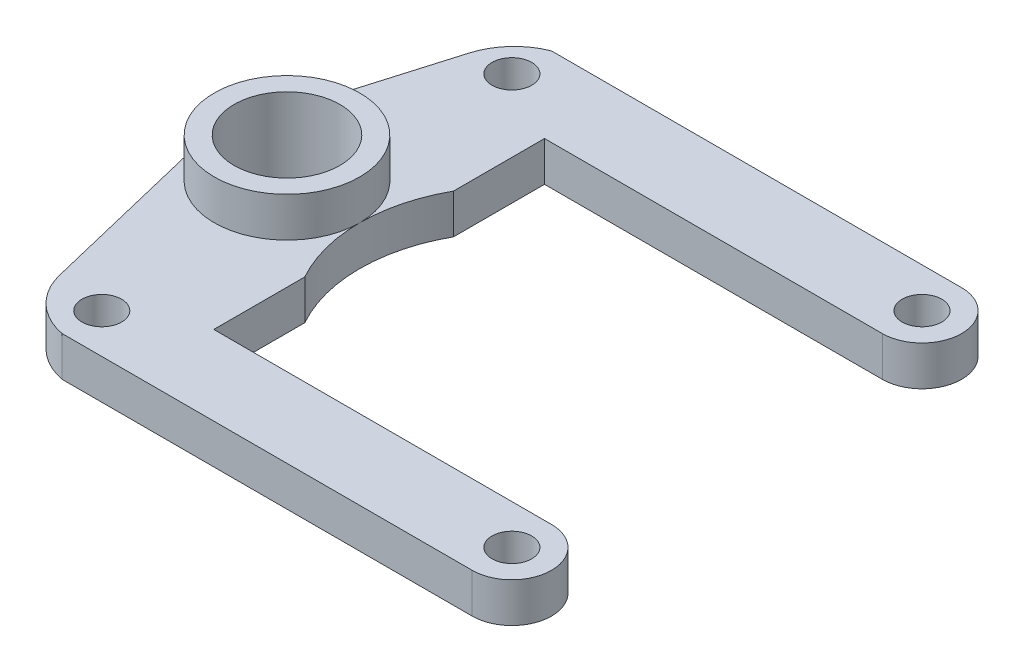
ISO-10303-21;
HEADER;
FILE_DESCRIPTION(('STEP AP214'),'2;1');
FILE_NAME('part.step','',(''),(''),'','','');
FILE_SCHEMA(('AUTOMOTIVE_DESIGN { 1 0 10303 214 1 1 1 1 }'));
ENDSEC;
DATA;
#1=APPLICATION_CONTEXT('core data for automotive mechanical design processes');
#2=APPLICATION_PROTOCOL_DEFINITION('international standard','automotive_design',2000,#1);
#3=PRODUCT_CONTEXT('',#1,'mechanical');
#4=PRODUCT('Part','Part','',(#3));
#5=PRODUCT_RELATED_PRODUCT_CATEGORY('part','',(#4));
#6=PRODUCT_DEFINITION_FORMATION('','',#4);
#7=PRODUCT_DEFINITION_CONTEXT('part definition',#1,'design');
#8=PRODUCT_DEFINITION('design','',#6,#7);
#9=PRODUCT_DEFINITION_SHAPE('','',#8);
#10=(LENGTH_UNIT() NAMED_UNIT(*) SI_UNIT(.MILLI.,.METRE.));
#11=(NAMED_UNIT(*) PLANE_ANGLE_UNIT() SI_UNIT($,.RADIAN.));
#12=(NAMED_UNIT(*) SI_UNIT($,.STERADIAN.) SOLID_ANGLE_UNIT());
#13=UNCERTAINTY_MEASURE_WITH_UNIT(LENGTH_MEASURE(1.E-05),#10,'distance_accuracy_value','');
#14=(GEOMETRIC_REPRESENTATION_CONTEXT(3) GLOBAL_UNCERTAINTY_ASSIGNED_CONTEXT((#13)) GLOBAL_UNIT_ASSIGNED_CONTEXT((#10,
#11,#12)) REPRESENTATION_CONTEXT('',''));
#15=CARTESIAN_POINT('',(0.,0.,0.));
#16=DIRECTION('',(0.,0.,1.));
#17=DIRECTION('',(1.,0.,0.));
#18=AXIS2_PLACEMENT_3D('',#15,#16,#17);
#19=CARTESIAN_POINT('',(31.,3.,0.));
#20=DIRECTION('',(0.,-1.,0.));
#21=DIRECTION('',(0.,0.,-1.));
#22=AXIS2_PLACEMENT_3D('',#19,#20,#21);
#23=PLANE('',#22);
#24=CARTESIAN_POINT('',(31.,3.,0.));
#25=DIRECTION('',(0.,1.,0.));
#26=DIRECTION('',(0.,0.,1.));
#27=AXIS2_PLACEMENT_3D('',#24,#25,#26);
#28=CIRCLE('',#27,1.5);
#29=CARTESIAN_POINT('',(31.,3.,1.5));
#30=VERTEX_POINT('',#29);
#31=EDGE_CURVE('E286',#30,#30,#28,.T.);
#32=ORIENTED_EDGE('',*,*,#31,.F.);
#33=EDGE_LOOP('',(#32));
#34=FACE_BOUND('',#33,.T.);
#35=CARTESIAN_POINT('',(0.,3.,-31.));
#36=DIRECTION('',(0.,1.,0.));
#37=DIRECTION('',(0.,0.,1.));
#38=AXIS2_PLACEMENT_3D('',#35,#36,#37);
#39=CIRCLE('',#38,1.5);
#40=CARTESIAN_POINT('',(0.,3.,-29.5));
#41=VERTEX_POINT('',#40);
#42=EDGE_CURVE('E163',#41,#41,#39,.T.);
#43=ORIENTED_EDGE('',*,*,#42,.F.);
#44=EDGE_LOOP('',(#43));
#45=FACE_BOUND('',#44,.T.);
#46=CARTESIAN_POINT('',(31.,3.,-31.));
#47=DIRECTION('',(0.,1.,0.));
#48=DIRECTION('',(0.,0.,1.));
#49=AXIS2_PLACEMENT_3D('',#46,#47,#48);
#50=CIRCLE('',#49,1.5);
#51=CARTESIAN_POINT('',(31.,3.,-29.5));
#52=VERTEX_POINT('',#51);
#53=EDGE_CURVE('E292',#52,#52,#50,.T.);
#54=ORIENTED_EDGE('',*,*,#53,.F.);
#55=EDGE_LOOP('',(#54));
#56=FACE_BOUND('',#55,.T.);
#57=CARTESIAN_POINT('',(0.,3.,0.));
#58=DIRECTION('',(0.,1.,0.));
#59=DIRECTION('',(0.,0.,1.));
#60=AXIS2_PLACEMENT_3D('',#57,#58,#59);
#61=CIRCLE('',#60,1.5);
#62=CARTESIAN_POINT('',(0.,3.,1.5));
#63=VERTEX_POINT('',#62);
#64=EDGE_CURVE('E280',#63,#63,#61,.T.);
#65=ORIENTED_EDGE('',*,*,#64,.F.);
#66=EDGE_LOOP('',(#65));
#67=FACE_BOUND('',#66,.T.);
#68=CARTESIAN_POINT('',(15.5,3.,-15.5));
#69=DIRECTION('',(0.,1.,0.));
#70=DIRECTION('',(0.,0.,1.));
#71=AXIS2_PLACEMENT_3D('',#68,#69,#70);
#72=CIRCLE('',#71,11.5);
#73=CARTESIAN_POINT('',(4.,3.,-15.5));
#74=VERTEX_POINT('',#73);
#75=CARTESIAN_POINT('',(5.46707237634791,3.,-9.87946948246351));
#76=VERTEX_POINT('',#75);
#77=EDGE_CURVE('E270',#74,#76,#72,.T.);
#78=ORIENTED_EDGE('',*,*,#77,.F.);
#79=CARTESIAN_POINT('',(-1.5,3.,-15.5));
#80=DIRECTION('',(0.,1.,0.));
#81=DIRECTION('',(0.,0.,1.));
#82=AXIS2_PLACEMENT_3D('',#79,#80,#81);
#83=CIRCLE('',#82,5.50000000000001);
#84=EDGE_CURVE('E267',#74,#74,#83,.T.);
#85=ORIENTED_EDGE('',*,*,#84,.F.);
#86=CARTESIAN_POINT('',(5.46707237634791,3.,-21.1205305175365));
#87=VERTEX_POINT('',#86);
#88=EDGE_CURVE('E264',#87,#74,#72,.T.);
#89=ORIENTED_EDGE('',*,*,#88,.F.);
#90=DIRECTION('',(0.,0.,-1.));
#91=VECTOR('',#90,1.);
#92=CARTESIAN_POINT('',(5.46707237634791,3.,-3.));
#93=LINE('',#92,#91);
#94=CARTESIAN_POINT('',(5.46707237634791,3.,-28.));
#95=VERTEX_POINT('',#94);
#96=EDGE_CURVE('E212',#87,#95,#93,.T.);
#97=ORIENTED_EDGE('',*,*,#96,.T.);
#98=DIRECTION('',(1.,0.,0.));
#99=VECTOR('',#98,1.);
#100=CARTESIAN_POINT('',(31.,3.,-28.));
#101=LINE('',#100,#99);
#102=CARTESIAN_POINT('',(31.,3.,-28.));
#103=VERTEX_POINT('',#102);
#104=EDGE_CURVE('E233',#95,#103,#101,.T.);
#105=ORIENTED_EDGE('',*,*,#104,.T.);
#106=CARTESIAN_POINT('',(31.,3.,-31.));
#107=DIRECTION('',(0.,1.,0.));
#108=DIRECTION('',(0.,0.,1.));
#109=AXIS2_PLACEMENT_3D('',#106,#107,#108);
#110=CIRCLE('',#109,3.);
#111=CARTESIAN_POINT('',(31.,3.,-34.));
#112=VERTEX_POINT('',#111);
#113=EDGE_CURVE('E230',#103,#112,#110,.T.);
#114=ORIENTED_EDGE('',*,*,#113,.T.);
#115=DIRECTION('',(-1.,0.,0.));
#116=VECTOR('',#115,1.);
#117=CARTESIAN_POINT('',(31.,3.,-34.));
#118=LINE('',#117,#116);
#119=CARTESIAN_POINT('',(0.,3.,-34.));
#120=VERTEX_POINT('',#119);
#121=EDGE_CURVE('E232',#112,#120,#118,.T.);
#122=ORIENTED_EDGE('',*,*,#121,.T.);
#123=CARTESIAN_POINT('',(1.82034544868609,3.,-29.3431402804628));
#124=DIRECTION('',(0.,1.,0.));
#125=DIRECTION('',(0.,0.,-1.));
#126=AXIS2_PLACEMENT_3D('',#123,#124,#125);
#127=CIRCLE('',#126,5.);
#128=CARTESIAN_POINT('',(-2.97461169510243,3.,-30.7603156363139));
#129=VERTEX_POINT('',#128);
#130=EDGE_CURVE('E235',#120,#129,#127,.T.);
#131=ORIENTED_EDGE('',*,*,#130,.T.);
#132=DIRECTION('',(-0.283435071170205,0.,0.958991428757703));
#133=VECTOR('',#132,1.);
#134=CARTESIAN_POINT('',(-7.48488000277803,3.,-15.5));
#135=LINE('',#134,#133);
#136=CARTESIAN_POINT('',(-7.48488000277803,3.,-15.5));
#137=VERTEX_POINT('',#136);
#138=EDGE_CURVE('E138',#129,#137,#135,.T.);
#139=ORIENTED_EDGE('',*,*,#138,.T.);
#140=DIRECTION('',(0.23488767197672,0.,0.972022521114278));
#141=VECTOR('',#140,1.);
#142=CARTESIAN_POINT('',(-7.48488000277803,3.,-15.5));
#143=LINE('',#142,#141);
#144=CARTESIAN_POINT('',(-3.91714401533258,3.,-0.735837623991746));
#145=VERTEX_POINT('',#144);
#146=EDGE_CURVE('E131',#137,#145,#143,.T.);
#147=ORIENTED_EDGE('',*,*,#146,.T.);
#148=CARTESIAN_POINT('',(0.942968590238806,3.,-1.91027598387535));
#149=DIRECTION('',(0.,1.,0.));
#150=DIRECTION('',(0.,0.,1.));
#151=AXIS2_PLACEMENT_3D('',#148,#149,#150);
#152=CIRCLE('',#151,5.);
#153=CARTESIAN_POINT('',(0.,3.,3.));
#154=VERTEX_POINT('',#153);
#155=EDGE_CURVE('E135',#145,#154,#152,.T.);
#156=ORIENTED_EDGE('',*,*,#155,.T.);
#157=DIRECTION('',(1.,0.,0.));
#158=VECTOR('',#157,1.);
#159=CARTESIAN_POINT('',(31.,3.,3.));
#160=LINE('',#159,#158);
#161=CARTESIAN_POINT('',(31.,3.,3.));
#162=VERTEX_POINT('',#161);
#163=EDGE_CURVE('E56',#154,#162,#160,.T.);
#164=ORIENTED_EDGE('',*,*,#163,.T.);
#165=CARTESIAN_POINT('',(31.,3.,0.));
#166=DIRECTION('',(0.,1.,0.));
#167=DIRECTION('',(0.,0.,-1.));
#168=AXIS2_PLACEMENT_3D('',#165,#166,#167);
#169=CIRCLE('',#168,3.);
#170=CARTESIAN_POINT('',(31.,3.,-3.));
#171=VERTEX_POINT('',#170);
#172=EDGE_CURVE('E183',#162,#171,#169,.T.);
#173=ORIENTED_EDGE('',*,*,#172,.T.);
#174=DIRECTION('',(-1.,0.,0.));
#175=VECTOR('',#174,1.);
#176=CARTESIAN_POINT('',(31.,3.,-3.));
#177=LINE('',#176,#175);
#178=CARTESIAN_POINT('',(5.46707237634791,3.,-3.));
#179=VERTEX_POINT('',#178);
#180=EDGE_CURVE('E107',#171,#179,#177,.T.);
#181=ORIENTED_EDGE('',*,*,#180,.T.);
#182=EDGE_CURVE('E237',#179,#76,#93,.T.);
#183=ORIENTED_EDGE('',*,*,#182,.T.);
#184=EDGE_LOOP('',(#78,#85,#89,#97,#105,#114,#122,#131,#139,#147,#156,#164,#173,#181,#183));
#185=FACE_BOUND('',#184,.T.);
#186=ADVANCED_FACE('F32',(#34,#45,#56,#67,#185),#23,.F.);
#187=CARTESIAN_POINT('',(5.46707237634791,3.,-3.));
#188=DIRECTION('',(-1.,0.,0.));
#189=DIRECTION('',(0.,0.,1.));
#190=AXIS2_PLACEMENT_3D('',#187,#188,#189);
#191=PLANE('',#190);
#192=DIRECTION('',(0.,0.,-1.));
#193=VECTOR('',#192,1.);
#194=CARTESIAN_POINT('',(5.46707237634791,0.,-3.));
#195=LINE('',#194,#193);
#196=CARTESIAN_POINT('',(5.46707237634791,0.,-3.));
#197=VERTEX_POINT('',#196);
#198=CARTESIAN_POINT('',(5.46707237634791,0.,-9.87946948246351));
#199=VERTEX_POINT('',#198);
#200=EDGE_CURVE('E166',#197,#199,#195,.T.);
#201=ORIENTED_EDGE('',*,*,#200,.T.);
#202=DIRECTION('',(0.,1.,0.));
#203=VECTOR('',#202,1.);
#204=CARTESIAN_POINT('',(5.46707237634791,0.,-9.87946948246351));
#205=LINE('',#204,#203);
#206=EDGE_CURVE('E11',#199,#76,#205,.T.);
#207=ORIENTED_EDGE('',*,*,#206,.T.);
#208=ORIENTED_EDGE('',*,*,#182,.F.);
#209=DIRECTION('',(0.,-1.,0.));
#210=VECTOR('',#209,1.);
#211=CARTESIAN_POINT('',(5.46707237634791,3.,-3.));
#212=LINE('',#211,#210);
#213=EDGE_CURVE('E202',#179,#197,#212,.T.);
#214=ORIENTED_EDGE('',*,*,#213,.T.);
#215=EDGE_LOOP('',(#201,#207,#208,#214));
#216=FACE_BOUND('',#215,.T.);
#217=ADVANCED_FACE('F318',(#216),#191,.F.);
#218=CARTESIAN_POINT('',(31.,0.,0.));
#219=DIRECTION('',(0.,-1.,0.));
#220=DIRECTION('',(0.,0.,-1.));
#221=AXIS2_PLACEMENT_3D('',#218,#219,#220);
#222=PLANE('',#221);
#223=CARTESIAN_POINT('',(15.5,0.,-15.5));
#224=DIRECTION('',(0.,1.,0.));
#225=DIRECTION('',(0.,0.,1.));
#226=AXIS2_PLACEMENT_3D('',#223,#224,#225);
#227=CIRCLE('',#226,11.5);
#228=CARTESIAN_POINT('',(5.46707237634791,0.,-21.1205305175365));
#229=VERTEX_POINT('',#228);
#230=EDGE_CURVE('E47',#229,#199,#227,.T.);
#231=ORIENTED_EDGE('',*,*,#230,.T.);
#232=ORIENTED_EDGE('',*,*,#200,.F.);
#233=DIRECTION('',(-1.,0.,0.));
#234=VECTOR('',#233,1.);
#235=CARTESIAN_POINT('',(31.,0.,-3.));
#236=LINE('',#235,#234);
#237=CARTESIAN_POINT('',(31.,0.,-3.));
#238=VERTEX_POINT('',#237);
#239=EDGE_CURVE('E162',#238,#197,#236,.T.);
#240=ORIENTED_EDGE('',*,*,#239,.F.);
#241=CARTESIAN_POINT('',(31.,0.,0.));
#242=DIRECTION('',(0.,1.,0.));
#243=DIRECTION('',(0.,0.,-1.));
#244=AXIS2_PLACEMENT_3D('',#241,#242,#243);
#245=CIRCLE('',#244,3.);
#246=CARTESIAN_POINT('',(31.,0.,3.));
#247=VERTEX_POINT('',#246);
#248=EDGE_CURVE('E159',#247,#238,#245,.T.);
#249=ORIENTED_EDGE('',*,*,#248,.F.);
#250=DIRECTION('',(1.,0.,0.));
#251=VECTOR('',#250,1.);
#252=CARTESIAN_POINT('',(31.,0.,3.));
#253=LINE('',#252,#251);
#254=CARTESIAN_POINT('',(0.,0.,3.));
#255=VERTEX_POINT('',#254);
#256=EDGE_CURVE('E98',#255,#247,#253,.T.);
#257=ORIENTED_EDGE('',*,*,#256,.F.);
#258=CARTESIAN_POINT('',(0.942968590238806,0.,-1.91027598387535));
#259=DIRECTION('',(0.,1.,0.));
#260=DIRECTION('',(0.,0.,1.));
#261=AXIS2_PLACEMENT_3D('',#258,#259,#260);
#262=CIRCLE('',#261,5.);
#263=CARTESIAN_POINT('',(-3.91714401533258,0.,-0.735837623991746));
#264=VERTEX_POINT('',#263);
#265=EDGE_CURVE('E180',#264,#255,#262,.T.);
#266=ORIENTED_EDGE('',*,*,#265,.F.);
#267=DIRECTION('',(0.23488767197672,0.,0.972022521114278));
#268=VECTOR('',#267,1.);
#269=CARTESIAN_POINT('',(-7.48488000277803,0.,-15.5));
#270=LINE('',#269,#268);
#271=CARTESIAN_POINT('',(-7.48488000277803,0.,-15.5));
#272=VERTEX_POINT('',#271);
#273=EDGE_CURVE('E147',#272,#264,#270,.T.);
#274=ORIENTED_EDGE('',*,*,#273,.F.);
#275=DIRECTION('',(-0.283435071170205,0.,0.958991428757703));
#276=VECTOR('',#275,1.);
#277=CARTESIAN_POINT('',(-7.48488000277803,0.,-15.5));
#278=LINE('',#277,#276);
#279=CARTESIAN_POINT('',(-2.97461169510243,0.,-30.7603156363139));
#280=VERTEX_POINT('',#279);
#281=EDGE_CURVE('E177',#280,#272,#278,.T.);
#282=ORIENTED_EDGE('',*,*,#281,.F.);
#283=CARTESIAN_POINT('',(1.82034544868609,0.,-29.3431402804628));
#284=DIRECTION('',(0.,1.,0.));
#285=DIRECTION('',(0.,0.,-1.));
#286=AXIS2_PLACEMENT_3D('',#283,#284,#285);
#287=CIRCLE('',#286,5.);
#288=CARTESIAN_POINT('',(0.,0.,-34.));
#289=VERTEX_POINT('',#288);
#290=EDGE_CURVE('E175',#289,#280,#287,.T.);
#291=ORIENTED_EDGE('',*,*,#290,.F.);
#292=DIRECTION('',(-1.,0.,0.));
#293=VECTOR('',#292,1.);
#294=CARTESIAN_POINT('',(31.,0.,-34.));
#295=LINE('',#294,#293);
#296=CARTESIAN_POINT('',(31.,0.,-34.));
#297=VERTEX_POINT('',#296);
#298=EDGE_CURVE('E173',#297,#289,#295,.T.);
#299=ORIENTED_EDGE('',*,*,#298,.F.);
#300=CARTESIAN_POINT('',(31.,0.,-31.));
#301=DIRECTION('',(0.,1.,0.));
#302=DIRECTION('',(0.,0.,1.));
#303=AXIS2_PLACEMENT_3D('',#300,#301,#302);
#304=CIRCLE('',#303,3.);
#305=CARTESIAN_POINT('',(31.,0.,-28.));
#306=VERTEX_POINT('',#305);
#307=EDGE_CURVE('E171',#306,#297,#304,.T.);
#308=ORIENTED_EDGE('',*,*,#307,.F.);
#309=DIRECTION('',(1.,0.,0.));
#310=VECTOR('',#309,1.);
#311=CARTESIAN_POINT('',(31.,0.,-28.));
#312=LINE('',#311,#310);
#313=CARTESIAN_POINT('',(5.46707237634791,0.,-28.));
#314=VERTEX_POINT('',#313);
#315=EDGE_CURVE('E169',#314,#306,#312,.T.);
#316=ORIENTED_EDGE('',*,*,#315,.F.);
#317=EDGE_CURVE('E165',#229,#314,#195,.T.);
#318=ORIENTED_EDGE('',*,*,#317,.F.);
#319=EDGE_LOOP('',(#231,#232,#240,#249,#257,#266,#274,#282,#291,#299,#308,#316,#318));
#320=FACE_BOUND('',#319,.T.);
#321=CARTESIAN_POINT('',(0.,0.,0.));
#322=DIRECTION('',(0.,1.,0.));
#323=DIRECTION('',(0.,0.,1.));
#324=AXIS2_PLACEMENT_3D('',#321,#322,#323);
#325=CIRCLE('',#324,1.5);
#326=CARTESIAN_POINT('',(0.,0.,1.5));
#327=VERTEX_POINT('',#326);
#328=EDGE_CURVE('E279',#327,#327,#325,.T.);
#329=ORIENTED_EDGE('',*,*,#328,.T.);
#330=EDGE_LOOP('',(#329));
#331=FACE_BOUND('',#330,.T.);
#332=CARTESIAN_POINT('',(31.,0.,-31.));
#333=DIRECTION('',(0.,1.,0.));
#334=DIRECTION('',(0.,0.,1.));
#335=AXIS2_PLACEMENT_3D('',#332,#333,#334);
#336=CIRCLE('',#335,1.5);
#337=CARTESIAN_POINT('',(31.,0.,-29.5));
#338=VERTEX_POINT('',#337);
#339=EDGE_CURVE('E289',#338,#338,#336,.T.);
#340=ORIENTED_EDGE('',*,*,#339,.T.);
#341=EDGE_LOOP('',(#340));
#342=FACE_BOUND('',#341,.T.);
#343=CARTESIAN_POINT('',(0.,0.,-31.));
#344=DIRECTION('',(0.,1.,0.));
#345=DIRECTION('',(0.,0.,1.));
#346=AXIS2_PLACEMENT_3D('',#343,#344,#345);
#347=CIRCLE('',#346,1.5);
#348=CARTESIAN_POINT('',(0.,0.,-29.5));
#349=VERTEX_POINT('',#348);
#350=EDGE_CURVE('E258',#349,#349,#347,.T.);
#351=ORIENTED_EDGE('',*,*,#350,.T.);
#352=EDGE_LOOP('',(#351));
#353=FACE_BOUND('',#352,.T.);
#354=CARTESIAN_POINT('',(31.,0.,0.));
#355=DIRECTION('',(0.,1.,0.));
#356=DIRECTION('',(0.,0.,1.));
#357=AXIS2_PLACEMENT_3D('',#354,#355,#356);
#358=CIRCLE('',#357,1.5);
#359=CARTESIAN_POINT('',(31.,0.,1.5));
#360=VERTEX_POINT('',#359);
#361=EDGE_CURVE('E283',#360,#360,#358,.T.);
#362=ORIENTED_EDGE('',*,*,#361,.T.);
#363=EDGE_LOOP('',(#362));
#364=FACE_BOUND('',#363,.T.);
#365=CARTESIAN_POINT('',(-1.5,0.,-15.5));
#366=DIRECTION('',(0.,1.,0.));
#367=DIRECTION('',(0.,0.,1.));
#368=AXIS2_PLACEMENT_3D('',#365,#366,#367);
#369=CIRCLE('',#368,4.);
#370=CARTESIAN_POINT('',(-1.5,0.,-11.5));
#371=VERTEX_POINT('',#370);
#372=EDGE_CURVE('E272',#371,#371,#369,.T.);
#373=ORIENTED_EDGE('',*,*,#372,.T.);
#374=EDGE_LOOP('',(#373));
#375=FACE_BOUND('',#374,.T.);
#376=ADVANCED_FACE('F217',(#320,#331,#342,#353,#364,#375),#222,.T.);
#377=CARTESIAN_POINT('',(31.,3.,0.));
#378=DIRECTION('',(0.,-1.,0.));
#379=DIRECTION('',(0.,0.,-1.));
#380=AXIS2_PLACEMENT_3D('',#377,#378,#379);
#381=CYLINDRICAL_SURFACE('',#380,3.);
#382=ORIENTED_EDGE('',*,*,#248,.T.);
#383=DIRECTION('',(0.,-1.,0.));
#384=VECTOR('',#383,1.);
#385=CARTESIAN_POINT('',(31.,3.,-3.));
#386=LINE('',#385,#384);
#387=EDGE_CURVE('E205',#171,#238,#386,.T.);
#388=ORIENTED_EDGE('',*,*,#387,.F.);
#389=ORIENTED_EDGE('',*,*,#172,.F.);
#390=DIRECTION('',(0.,-1.,0.));
#391=VECTOR('',#390,1.);
#392=CARTESIAN_POINT('',(31.,3.,3.));
#393=LINE('',#392,#391);
#394=EDGE_CURVE('E155',#162,#247,#393,.T.);
#395=ORIENTED_EDGE('',*,*,#394,.T.);
#396=EDGE_LOOP('',(#382,#388,#389,#395));
#397=FACE_BOUND('',#396,.T.);
#398=ADVANCED_FACE('F34',(#397),#381,.T.);
#399=CARTESIAN_POINT('',(31.,3.,-3.));
#400=DIRECTION('',(0.,0.,1.));
#401=DIRECTION('',(1.,0.,0.));
#402=AXIS2_PLACEMENT_3D('',#399,#400,#401);
#403=PLANE('',#402);
#404=ORIENTED_EDGE('',*,*,#239,.T.);
#405=ORIENTED_EDGE('',*,*,#213,.F.);
#406=ORIENTED_EDGE('',*,*,#180,.F.);
#407=ORIENTED_EDGE('',*,*,#387,.T.);
#408=EDGE_LOOP('',(#404,#405,#406,#407));
#409=FACE_BOUND('',#408,.T.);
#410=ADVANCED_FACE('F346',(#409),#403,.F.);
#411=ORIENTED_EDGE('',*,*,#96,.F.);
#412=DIRECTION('',(0.,1.,0.));
#413=VECTOR('',#412,1.);
#414=CARTESIAN_POINT('',(5.46707237634791,0.,-21.1205305175365));
#415=LINE('',#414,#413);
#416=EDGE_CURVE('E40',#87,#229,#415,.F.);
#417=ORIENTED_EDGE('',*,*,#416,.T.);
#418=ORIENTED_EDGE('',*,*,#317,.T.);
#419=DIRECTION('',(0.,-1.,0.));
#420=VECTOR('',#419,1.);
#421=CARTESIAN_POINT('',(5.46707237634791,3.,-28.));
#422=LINE('',#421,#420);
#423=EDGE_CURVE('E199',#95,#314,#422,.T.);
#424=ORIENTED_EDGE('',*,*,#423,.F.);
#425=EDGE_LOOP('',(#411,#417,#418,#424));
#426=FACE_BOUND('',#425,.T.);
#427=ADVANCED_FACE('F209',(#426),#191,.F.);
#428=CARTESIAN_POINT('',(31.,3.,-28.));
#429=DIRECTION('',(0.,0.,-1.));
#430=DIRECTION('',(-1.,0.,0.));
#431=AXIS2_PLACEMENT_3D('',#428,#429,#430);
#432=PLANE('',#431);
#433=ORIENTED_EDGE('',*,*,#315,.T.);
#434=DIRECTION('',(0.,-1.,0.));
#435=VECTOR('',#434,1.);
#436=CARTESIAN_POINT('',(31.,3.,-28.));
#437=LINE('',#436,#435);
#438=EDGE_CURVE('E196',#103,#306,#437,.T.);
#439=ORIENTED_EDGE('',*,*,#438,.F.);
#440=ORIENTED_EDGE('',*,*,#104,.F.);
#441=ORIENTED_EDGE('',*,*,#423,.T.);
#442=EDGE_LOOP('',(#433,#439,#440,#441));
#443=FACE_BOUND('',#442,.T.);
#444=ADVANCED_FACE('F224',(#443),#432,.F.);
#445=CARTESIAN_POINT('',(31.,3.,-31.));
#446=DIRECTION('',(0.,-1.,0.));
#447=DIRECTION('',(0.,0.,-1.));
#448=AXIS2_PLACEMENT_3D('',#445,#446,#447);
#449=CYLINDRICAL_SURFACE('',#448,3.);
#450=ORIENTED_EDGE('',*,*,#307,.T.);
#451=DIRECTION('',(0.,-1.,0.));
#452=VECTOR('',#451,1.);
#453=CARTESIAN_POINT('',(31.,3.,-34.));
#454=LINE('',#453,#452);
#455=EDGE_CURVE('E193',#112,#297,#454,.T.);
#456=ORIENTED_EDGE('',*,*,#455,.F.);
#457=ORIENTED_EDGE('',*,*,#113,.F.);
#458=ORIENTED_EDGE('',*,*,#438,.T.);
#459=EDGE_LOOP('',(#450,#456,#457,#458));
#460=FACE_BOUND('',#459,.T.);
#461=ADVANCED_FACE('F228',(#460),#449,.T.);
#462=CARTESIAN_POINT('',(31.,3.,-34.));
#463=DIRECTION('',(0.,0.,1.));
#464=DIRECTION('',(1.,0.,0.));
#465=AXIS2_PLACEMENT_3D('',#462,#463,#464);
#466=PLANE('',#465);
#467=ORIENTED_EDGE('',*,*,#298,.T.);
#468=DIRECTION('',(0.,-1.,0.));
#469=VECTOR('',#468,1.);
#470=CARTESIAN_POINT('',(0.,3.,-34.));
#471=LINE('',#470,#469);
#472=EDGE_CURVE('E190',#120,#289,#471,.T.);
#473=ORIENTED_EDGE('',*,*,#472,.F.);
#474=ORIENTED_EDGE('',*,*,#121,.F.);
#475=ORIENTED_EDGE('',*,*,#455,.T.);
#476=EDGE_LOOP('',(#467,#473,#474,#475));
#477=FACE_BOUND('',#476,.T.);
#478=ADVANCED_FACE('F338',(#477),#466,.F.);
#479=CARTESIAN_POINT('',(1.82034544868609,3.,-29.3431402804628));
#480=DIRECTION('',(0.,-1.,0.));
#481=DIRECTION('',(0.,0.,-1.));
#482=AXIS2_PLACEMENT_3D('',#479,#480,#481);
#483=CYLINDRICAL_SURFACE('',#482,5.);
#484=ORIENTED_EDGE('',*,*,#290,.T.);
#485=DIRECTION('',(0.,-1.,0.));
#486=VECTOR('',#485,1.);
#487=CARTESIAN_POINT('',(-2.97461169510243,3.,-30.7603156363139));
#488=LINE('',#487,#486);
#489=EDGE_CURVE('E187',#129,#280,#488,.T.);
#490=ORIENTED_EDGE('',*,*,#489,.F.);
#491=ORIENTED_EDGE('',*,*,#130,.F.);
#492=ORIENTED_EDGE('',*,*,#472,.T.);
#493=EDGE_LOOP('',(#484,#490,#491,#492));
#494=FACE_BOUND('',#493,.T.);
#495=ADVANCED_FACE('F245',(#494),#483,.T.);
#496=CARTESIAN_POINT('',(-7.48488000277803,3.,-15.5));
#497=DIRECTION('',(0.958991428757703,0.,0.283435071170205));
#498=DIRECTION('',(0.283435071170205,0.,-0.958991428757703));
#499=AXIS2_PLACEMENT_3D('',#496,#497,#498);
#500=PLANE('',#499);
#501=ORIENTED_EDGE('',*,*,#281,.T.);
#502=DIRECTION('',(0.,-1.,0.));
#503=VECTOR('',#502,1.);
#504=CARTESIAN_POINT('',(-7.48488000277803,3.,-15.5));
#505=LINE('',#504,#503);
#506=EDGE_CURVE('E150',#137,#272,#505,.T.);
#507=ORIENTED_EDGE('',*,*,#506,.F.);
#508=ORIENTED_EDGE('',*,*,#138,.F.);
#509=ORIENTED_EDGE('',*,*,#489,.T.);
#510=EDGE_LOOP('',(#501,#507,#508,#509));
#511=FACE_BOUND('',#510,.T.);
#512=ADVANCED_FACE('F249',(#511),#500,.F.);
#513=CARTESIAN_POINT('',(-7.48488000277803,3.,-15.5));
#514=DIRECTION('',(0.972022521114278,0.,-0.23488767197672));
#515=DIRECTION('',(-0.23488767197672,0.,-0.972022521114278));
#516=AXIS2_PLACEMENT_3D('',#513,#514,#515);
#517=PLANE('',#516);
#518=ORIENTED_EDGE('',*,*,#273,.T.);
#519=DIRECTION('',(0.,-1.,0.));
#520=VECTOR('',#519,1.);
#521=CARTESIAN_POINT('',(-3.91714401533258,3.,-0.735837623991746));
#522=LINE('',#521,#520);
#523=EDGE_CURVE('E144',#145,#264,#522,.T.);
#524=ORIENTED_EDGE('',*,*,#523,.F.);
#525=ORIENTED_EDGE('',*,*,#146,.F.);
#526=ORIENTED_EDGE('',*,*,#506,.T.);
#527=EDGE_LOOP('',(#518,#524,#525,#526));
#528=FACE_BOUND('',#527,.T.);
#529=ADVANCED_FACE('F145',(#528),#517,.F.);
#530=CARTESIAN_POINT('',(0.942968590238806,3.,-1.91027598387535));
#531=DIRECTION('',(0.,-1.,0.));
#532=DIRECTION('',(0.,0.,-1.));
#533=AXIS2_PLACEMENT_3D('',#530,#531,#532);
#534=CYLINDRICAL_SURFACE('',#533,5.);
#535=ORIENTED_EDGE('',*,*,#265,.T.);
#536=DIRECTION('',(0.,-1.,0.));
#537=VECTOR('',#536,1.);
#538=CARTESIAN_POINT('',(0.,3.,3.));
#539=LINE('',#538,#537);
#540=EDGE_CURVE('E151',#154,#255,#539,.T.);
#541=ORIENTED_EDGE('',*,*,#540,.F.);
#542=ORIENTED_EDGE('',*,*,#155,.F.);
#543=ORIENTED_EDGE('',*,*,#523,.T.);
#544=EDGE_LOOP('',(#535,#541,#542,#543));
#545=FACE_BOUND('',#544,.T.);
#546=ADVANCED_FACE('F153',(#545),#534,.T.);
#547=CARTESIAN_POINT('',(31.,3.,3.));
#548=DIRECTION('',(0.,0.,-1.));
#549=DIRECTION('',(-1.,0.,0.));
#550=AXIS2_PLACEMENT_3D('',#547,#548,#549);
#551=PLANE('',#550);
#552=ORIENTED_EDGE('',*,*,#256,.T.);
#553=ORIENTED_EDGE('',*,*,#394,.F.);
#554=ORIENTED_EDGE('',*,*,#163,.F.);
#555=ORIENTED_EDGE('',*,*,#540,.T.);
#556=EDGE_LOOP('',(#552,#553,#554,#555));
#557=FACE_BOUND('',#556,.T.);
#558=ADVANCED_FACE('F251',(#557),#551,.F.);
#559=CARTESIAN_POINT('',(0.,3.,-31.));
#560=DIRECTION('',(0.,-1.,0.));
#561=DIRECTION('',(0.,0.,-1.));
#562=AXIS2_PLACEMENT_3D('',#559,#560,#561);
#563=CYLINDRICAL_SURFACE('',#562,1.5);
#564=ORIENTED_EDGE('',*,*,#42,.T.);
#565=EDGE_LOOP('',(#564));
#566=FACE_BOUND('',#565,.T.);
#567=ORIENTED_EDGE('',*,*,#350,.F.);
#568=EDGE_LOOP('',(#567));
#569=FACE_BOUND('',#568,.T.);
#570=ADVANCED_FACE('F304',(#566,#569),#563,.F.);
#571=CARTESIAN_POINT('',(31.,3.,-31.));
#572=DIRECTION('',(0.,-1.,0.));
#573=DIRECTION('',(0.,0.,-1.));
#574=AXIS2_PLACEMENT_3D('',#571,#572,#573);
#575=CYLINDRICAL_SURFACE('',#574,1.5);
#576=ORIENTED_EDGE('',*,*,#53,.T.);
#577=EDGE_LOOP('',(#576));
#578=FACE_BOUND('',#577,.T.);
#579=ORIENTED_EDGE('',*,*,#339,.F.);
#580=EDGE_LOOP('',(#579));
#581=FACE_BOUND('',#580,.T.);
#582=ADVANCED_FACE('F306',(#578,#581),#575,.F.);
#583=CARTESIAN_POINT('',(31.,3.,0.));
#584=DIRECTION('',(0.,-1.,0.));
#585=DIRECTION('',(0.,0.,-1.));
#586=AXIS2_PLACEMENT_3D('',#583,#584,#585);
#587=CYLINDRICAL_SURFACE('',#586,1.5);
#588=ORIENTED_EDGE('',*,*,#31,.T.);
#589=EDGE_LOOP('',(#588));
#590=FACE_BOUND('',#589,.T.);
#591=ORIENTED_EDGE('',*,*,#361,.F.);
#592=EDGE_LOOP('',(#591));
#593=FACE_BOUND('',#592,.T.);
#594=ADVANCED_FACE('F312',(#590,#593),#587,.F.);
#595=CARTESIAN_POINT('',(0.,3.,0.));
#596=DIRECTION('',(0.,-1.,0.));
#597=DIRECTION('',(0.,0.,-1.));
#598=AXIS2_PLACEMENT_3D('',#595,#596,#597);
#599=CYLINDRICAL_SURFACE('',#598,1.5);
#600=ORIENTED_EDGE('',*,*,#64,.T.);
#601=EDGE_LOOP('',(#600));
#602=FACE_BOUND('',#601,.T.);
#603=ORIENTED_EDGE('',*,*,#328,.F.);
#604=EDGE_LOOP('',(#603));
#605=FACE_BOUND('',#604,.T.);
#606=ADVANCED_FACE('F364',(#602,#605),#599,.F.);
#607=CARTESIAN_POINT('',(-1.5,3.,-15.5));
#608=DIRECTION('',(0.,-1.,0.));
#609=DIRECTION('',(0.,0.,-1.));
#610=AXIS2_PLACEMENT_3D('',#607,#608,#609);
#611=CYLINDRICAL_SURFACE('',#610,4.);
#612=ORIENTED_EDGE('',*,*,#372,.F.);
#613=EDGE_LOOP('',(#612));
#614=FACE_BOUND('',#613,.T.);
#615=CARTESIAN_POINT('',(-1.5,6.,-15.5));
#616=DIRECTION('',(0.,1.,0.));
#617=DIRECTION('',(0.,0.,1.));
#618=AXIS2_PLACEMENT_3D('',#615,#616,#617);
#619=CIRCLE('',#618,4.);
#620=CARTESIAN_POINT('',(-1.5,6.,-11.5));
#621=VERTEX_POINT('',#620);
#622=EDGE_CURVE('E383',#621,#621,#619,.T.);
#623=ORIENTED_EDGE('',*,*,#622,.T.);
#624=EDGE_LOOP('',(#623));
#625=FACE_BOUND('',#624,.T.);
#626=ADVANCED_FACE('F355',(#614,#625),#611,.F.);
#627=CARTESIAN_POINT('',(15.5,0.,-15.5));
#628=DIRECTION('',(0.,1.,0.));
#629=DIRECTION('',(0.,0.,1.));
#630=AXIS2_PLACEMENT_3D('',#627,#628,#629);
#631=CYLINDRICAL_SURFACE('',#630,11.5);
#632=ORIENTED_EDGE('',*,*,#230,.F.);
#633=ORIENTED_EDGE('',*,*,#416,.F.);
#634=ORIENTED_EDGE('',*,*,#88,.T.);
#635=ORIENTED_EDGE('',*,*,#77,.T.);
#636=ORIENTED_EDGE('',*,*,#206,.F.);
#637=EDGE_LOOP('',(#632,#633,#634,#635,#636));
#638=FACE_BOUND('',#637,.T.);
#639=ADVANCED_FACE('F351',(#638),#631,.F.);
#640=CARTESIAN_POINT('',(-1.5,6.,-15.5));
#641=DIRECTION('',(0.,1.,0.));
#642=DIRECTION('',(0.,0.,1.));
#643=AXIS2_PLACEMENT_3D('',#640,#641,#642);
#644=PLANE('',#643);
#645=CARTESIAN_POINT('',(-1.5,6.,-15.5));
#646=DIRECTION('',(0.,1.,0.));
#647=DIRECTION('',(0.,0.,1.));
#648=AXIS2_PLACEMENT_3D('',#645,#646,#647);
#649=CIRCLE('',#648,5.50000000000001);
#650=CARTESIAN_POINT('',(-1.5,6.,-9.99999999999999));
#651=VERTEX_POINT('',#650);
#652=EDGE_CURVE('E274',#651,#651,#649,.T.);
#653=ORIENTED_EDGE('',*,*,#652,.T.);
#654=EDGE_LOOP('',(#653));
#655=FACE_BOUND('',#654,.T.);
#656=ORIENTED_EDGE('',*,*,#622,.F.);
#657=EDGE_LOOP('',(#656));
#658=FACE_BOUND('',#657,.T.);
#659=ADVANCED_FACE('F354',(#655,#658),#644,.T.);
#660=CARTESIAN_POINT('',(-1.5,6.,-15.5));
#661=DIRECTION('',(0.,-1.,0.));
#662=DIRECTION('',(0.,0.,-1.));
#663=AXIS2_PLACEMENT_3D('',#660,#661,#662);
#664=CYLINDRICAL_SURFACE('',#663,5.50000000000001);
#665=ORIENTED_EDGE('',*,*,#652,.F.);
#666=EDGE_LOOP('',(#665));
#667=FACE_BOUND('',#666,.T.);
#668=ORIENTED_EDGE('',*,*,#84,.T.);
#669=EDGE_LOOP('',(#668));
#670=FACE_BOUND('',#669,.T.);
#671=ADVANCED_FACE('F361',(#667,#670),#664,.T.);
#672=CLOSED_SHELL('',(#186,#217,#376,#398,#410,#427,#444,#461,#478,#495,#512,#529,#546,#558,
#570,#582,#594,#606,#626,#639,#659,#671));
#673=MANIFOLD_SOLID_BREP('B2',#672);
#674=ADVANCED_BREP_SHAPE_REPRESENTATION('',(#18,#673),#14);
#675=SHAPE_DEFINITION_REPRESENTATION(#9,#674);
ENDSEC;
END-ISO-10303-21;
